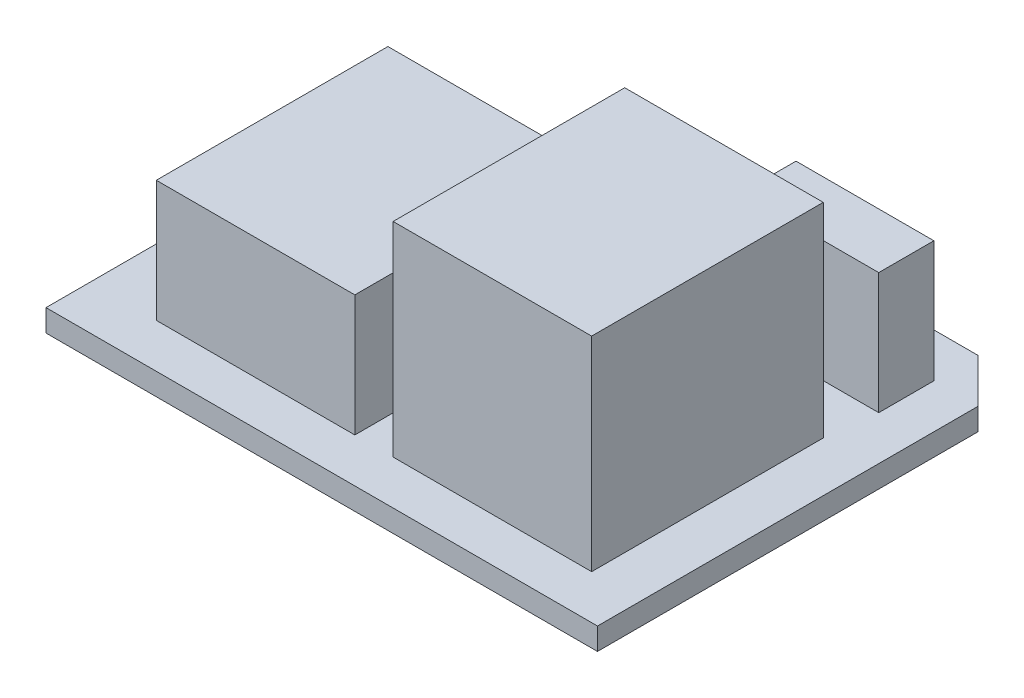
ISO-10303-21;
HEADER;
FILE_DESCRIPTION(('STEP AP214'),'2;1');
FILE_NAME('part.step','',(''),(''),'','','');
FILE_SCHEMA(('AUTOMOTIVE_DESIGN { 1 0 10303 214 1 1 1 1 }'));
ENDSEC;
DATA;
#1=APPLICATION_CONTEXT('core data for automotive mechanical design processes');
#2=APPLICATION_PROTOCOL_DEFINITION('international standard','automotive_design',2000,#1);
#3=PRODUCT_CONTEXT('',#1,'mechanical');
#4=PRODUCT('Part','Part','',(#3));
#5=PRODUCT_RELATED_PRODUCT_CATEGORY('part','',(#4));
#6=PRODUCT_DEFINITION_FORMATION('','',#4);
#7=PRODUCT_DEFINITION_CONTEXT('part definition',#1,'design');
#8=PRODUCT_DEFINITION('design','',#6,#7);
#9=PRODUCT_DEFINITION_SHAPE('','',#8);
#10=(LENGTH_UNIT() NAMED_UNIT(*) SI_UNIT(.MILLI.,.METRE.));
#11=(NAMED_UNIT(*) PLANE_ANGLE_UNIT() SI_UNIT($,.RADIAN.));
#12=(NAMED_UNIT(*) SI_UNIT($,.STERADIAN.) SOLID_ANGLE_UNIT());
#13=UNCERTAINTY_MEASURE_WITH_UNIT(LENGTH_MEASURE(1.E-05),#10,'distance_accuracy_value','');
#14=(GEOMETRIC_REPRESENTATION_CONTEXT(3) GLOBAL_UNCERTAINTY_ASSIGNED_CONTEXT((#13)) GLOBAL_UNIT_ASSIGNED_CONTEXT((#10,
#11,#12)) REPRESENTATION_CONTEXT('',''));
#15=CARTESIAN_POINT('',(0.,0.,0.));
#16=DIRECTION('',(0.,0.,1.));
#17=DIRECTION('',(1.,0.,0.));
#18=AXIS2_PLACEMENT_3D('',#15,#16,#17);
#19=CARTESIAN_POINT('',(0.,2.,0.));
#20=DIRECTION('',(0.,1.,0.));
#21=DIRECTION('',(0.,0.,1.));
#22=AXIS2_PLACEMENT_3D('',#19,#20,#21);
#23=PLANE('',#22);
#24=DIRECTION('',(0.707106781186548,0.,0.707106781186548));
#25=VECTOR('',#24,1.);
#26=CARTESIAN_POINT('',(20.125,2.,-20.125));
#27=LINE('',#26,#25);
#28=CARTESIAN_POINT('',(21.,2.,-19.25));
#29=VERTEX_POINT('',#28);
#30=CARTESIAN_POINT('',(25.,2.,-15.25));
#31=VERTEX_POINT('',#30);
#32=EDGE_CURVE('E296',#29,#31,#27,.T.);
#33=ORIENTED_EDGE('',*,*,#32,.F.);
#34=DIRECTION('',(1.,0.,0.));
#35=VECTOR('',#34,1.);
#36=CARTESIAN_POINT('',(0.,2.,-19.25));
#37=LINE('',#36,#35);
#38=CARTESIAN_POINT('',(5.5,2.,-19.25));
#39=VERTEX_POINT('',#38);
#40=EDGE_CURVE('E300',#39,#29,#37,.T.);
#41=ORIENTED_EDGE('',*,*,#40,.F.);
#42=DIRECTION('',(0.707106781186548,0.,-0.707106781186548));
#43=VECTOR('',#42,1.);
#44=CARTESIAN_POINT('',(-6.875,2.,-6.875));
#45=LINE('',#44,#43);
#46=CARTESIAN_POINT('',(-1.00000000000001,2.,-12.75));
#47=VERTEX_POINT('',#46);
#48=EDGE_CURVE('E305',#47,#39,#45,.T.);
#49=ORIENTED_EDGE('',*,*,#48,.F.);
#50=DIRECTION('',(1.,0.,0.));
#51=VECTOR('',#50,1.);
#52=CARTESIAN_POINT('',(0.,2.,-12.75));
#53=LINE('',#52,#51);
#54=CARTESIAN_POINT('',(-20.,2.,-12.75));
#55=VERTEX_POINT('',#54);
#56=EDGE_CURVE('E309',#55,#47,#53,.T.);
#57=ORIENTED_EDGE('',*,*,#56,.F.);
#58=DIRECTION('',(-0.707106781186548,0.,0.707106781186548));
#59=VECTOR('',#58,1.);
#60=CARTESIAN_POINT('',(-16.375,2.,-16.375));
#61=LINE('',#60,#59);
#62=CARTESIAN_POINT('',(-25.,2.,-7.75));
#63=VERTEX_POINT('',#62);
#64=EDGE_CURVE('E313',#55,#63,#61,.T.);
#65=ORIENTED_EDGE('',*,*,#64,.T.);
#66=DIRECTION('',(0.,0.,1.));
#67=VECTOR('',#66,1.);
#68=CARTESIAN_POINT('',(-25.,2.,0.));
#69=LINE('',#68,#67);
#70=CARTESIAN_POINT('',(-25.,2.,19.25));
#71=VERTEX_POINT('',#70);
#72=EDGE_CURVE('E316',#63,#71,#69,.T.);
#73=ORIENTED_EDGE('',*,*,#72,.T.);
#74=DIRECTION('',(1.,0.,0.));
#75=VECTOR('',#74,1.);
#76=CARTESIAN_POINT('',(0.,2.,19.25));
#77=LINE('',#76,#75);
#78=CARTESIAN_POINT('',(25.,2.,19.25));
#79=VERTEX_POINT('',#78);
#80=EDGE_CURVE('E319',#71,#79,#77,.T.);
#81=ORIENTED_EDGE('',*,*,#80,.T.);
#82=DIRECTION('',(0.,0.,1.));
#83=VECTOR('',#82,1.);
#84=CARTESIAN_POINT('',(25.,2.,0.));
#85=LINE('',#84,#83);
#86=EDGE_CURVE('E322',#31,#79,#85,.T.);
#87=ORIENTED_EDGE('',*,*,#86,.F.);
#88=EDGE_LOOP('',(#33,#41,#49,#57,#65,#73,#81,#87));
#89=FACE_BOUND('',#88,.T.);
#90=DIRECTION('',(-1.,0.,0.));
#91=VECTOR('',#90,1.);
#92=CARTESIAN_POINT('',(-19.,2.,-5.75));
#93=LINE('',#92,#91);
#94=CARTESIAN_POINT('',(-1.00000000000001,2.,-5.75));
#95=VERTEX_POINT('',#94);
#96=CARTESIAN_POINT('',(-19.,2.,-5.75));
#97=VERTEX_POINT('',#96);
#98=EDGE_CURVE('E273',#95,#97,#93,.T.);
#99=ORIENTED_EDGE('',*,*,#98,.F.);
#100=DIRECTION('',(0.,0.,-1.));
#101=VECTOR('',#100,1.);
#102=CARTESIAN_POINT('',(-1.00000000000001,2.,-5.75));
#103=LINE('',#102,#101);
#104=CARTESIAN_POINT('',(-1.00000000000001,2.,15.25));
#105=VERTEX_POINT('',#104);
#106=EDGE_CURVE('E254',#105,#95,#103,.T.);
#107=ORIENTED_EDGE('',*,*,#106,.F.);
#108=DIRECTION('',(1.,0.,0.));
#109=VECTOR('',#108,1.);
#110=CARTESIAN_POINT('',(-19.,2.,15.25));
#111=LINE('',#110,#109);
#112=CARTESIAN_POINT('',(-19.,2.,15.25));
#113=VERTEX_POINT('',#112);
#114=EDGE_CURVE('E260',#113,#105,#111,.T.);
#115=ORIENTED_EDGE('',*,*,#114,.F.);
#116=DIRECTION('',(0.,0.,1.));
#117=VECTOR('',#116,1.);
#118=CARTESIAN_POINT('',(-19.,2.,-5.75));
#119=LINE('',#118,#117);
#120=EDGE_CURVE('E276',#97,#113,#119,.T.);
#121=ORIENTED_EDGE('',*,*,#120,.F.);
#122=EDGE_LOOP('',(#99,#107,#115,#121));
#123=FACE_BOUND('',#122,.T.);
#124=DIRECTION('',(-1.,0.,0.));
#125=VECTOR('',#124,1.);
#126=CARTESIAN_POINT('',(2.47105650587214,2.,-5.75));
#127=LINE('',#126,#125);
#128=CARTESIAN_POINT('',(20.4710565058721,2.,-5.75));
#129=VERTEX_POINT('',#128);
#130=CARTESIAN_POINT('',(2.47105650587214,2.,-5.75));
#131=VERTEX_POINT('',#130);
#132=EDGE_CURVE('E215',#129,#131,#127,.T.);
#133=ORIENTED_EDGE('',*,*,#132,.F.);
#134=DIRECTION('',(0.,0.,-1.));
#135=VECTOR('',#134,1.);
#136=CARTESIAN_POINT('',(20.4710565058721,2.,-5.75));
#137=LINE('',#136,#135);
#138=CARTESIAN_POINT('',(20.4710565058721,2.,15.25));
#139=VERTEX_POINT('',#138);
#140=EDGE_CURVE('E210',#139,#129,#137,.T.);
#141=ORIENTED_EDGE('',*,*,#140,.F.);
#142=DIRECTION('',(1.,0.,0.));
#143=VECTOR('',#142,1.);
#144=CARTESIAN_POINT('',(2.47105650587215,2.,15.25));
#145=LINE('',#144,#143);
#146=CARTESIAN_POINT('',(2.47105650587215,2.,15.25));
#147=VERTEX_POINT('',#146);
#148=EDGE_CURVE('E225',#147,#139,#145,.T.);
#149=ORIENTED_EDGE('',*,*,#148,.F.);
#150=DIRECTION('',(0.,0.,1.));
#151=VECTOR('',#150,1.);
#152=CARTESIAN_POINT('',(2.47105650587214,2.,-5.75));
#153=LINE('',#152,#151);
#154=EDGE_CURVE('E237',#131,#147,#153,.T.);
#155=ORIENTED_EDGE('',*,*,#154,.F.);
#156=EDGE_LOOP('',(#133,#141,#149,#155));
#157=FACE_BOUND('',#156,.T.);
#158=DIRECTION('',(-1.,0.,0.));
#159=VECTOR('',#158,1.);
#160=CARTESIAN_POINT('',(8.5,2.,-15.25));
#161=LINE('',#160,#159);
#162=CARTESIAN_POINT('',(21.,2.,-15.25));
#163=VERTEX_POINT('',#162);
#164=CARTESIAN_POINT('',(8.5,2.,-15.25));
#165=VERTEX_POINT('',#164);
#166=EDGE_CURVE('E691',#163,#165,#161,.T.);
#167=ORIENTED_EDGE('',*,*,#166,.F.);
#168=DIRECTION('',(0.,0.,-1.));
#169=VECTOR('',#168,1.);
#170=CARTESIAN_POINT('',(21.,2.,-15.25));
#171=LINE('',#170,#169);
#172=CARTESIAN_POINT('',(21.,2.,-10.25));
#173=VERTEX_POINT('',#172);
#174=EDGE_CURVE('E207',#173,#163,#171,.T.);
#175=ORIENTED_EDGE('',*,*,#174,.F.);
#176=DIRECTION('',(1.,0.,0.));
#177=VECTOR('',#176,1.);
#178=CARTESIAN_POINT('',(8.5,2.,-10.25));
#179=LINE('',#178,#177);
#180=CARTESIAN_POINT('',(8.5,2.,-10.25));
#181=VERTEX_POINT('',#180);
#182=EDGE_CURVE('E203',#181,#173,#179,.T.);
#183=ORIENTED_EDGE('',*,*,#182,.F.);
#184=DIRECTION('',(0.,0.,1.));
#185=VECTOR('',#184,1.);
#186=CARTESIAN_POINT('',(8.5,2.,-15.25));
#187=LINE('',#186,#185);
#188=EDGE_CURVE('E687',#165,#181,#187,.T.);
#189=ORIENTED_EDGE('',*,*,#188,.F.);
#190=EDGE_LOOP('',(#167,#175,#183,#189));
#191=FACE_BOUND('',#190,.T.);
#192=ADVANCED_FACE('F44',(#89,#123,#157,#191),#23,.T.);
#193=CARTESIAN_POINT('',(20.125,2.,-20.125));
#194=DIRECTION('',(0.707106781186547,0.,-0.707106781186547));
#195=DIRECTION('',(-0.707106781186548,0.,-0.707106781186548));
#196=AXIS2_PLACEMENT_3D('',#193,#194,#195);
#197=PLANE('',#196);
#198=DIRECTION('',(0.707106781186548,0.,0.707106781186548));
#199=VECTOR('',#198,1.);
#200=CARTESIAN_POINT('',(20.125,0.,-20.125));
#201=LINE('',#200,#199);
#202=CARTESIAN_POINT('',(21.,0.,-19.25));
#203=VERTEX_POINT('',#202);
#204=CARTESIAN_POINT('',(25.,0.,-15.25));
#205=VERTEX_POINT('',#204);
#206=EDGE_CURVE('E295',#203,#205,#201,.T.);
#207=ORIENTED_EDGE('',*,*,#206,.F.);
#208=DIRECTION('',(0.,-1.,0.));
#209=VECTOR('',#208,1.);
#210=CARTESIAN_POINT('',(21.,2.,-19.25));
#211=LINE('',#210,#209);
#212=EDGE_CURVE('E11',#29,#203,#211,.T.);
#213=ORIENTED_EDGE('',*,*,#212,.F.);
#214=ORIENTED_EDGE('',*,*,#32,.T.);
#215=DIRECTION('',(0.,-1.,0.));
#216=VECTOR('',#215,1.);
#217=CARTESIAN_POINT('',(25.,2.,-15.25));
#218=LINE('',#217,#216);
#219=EDGE_CURVE('E326',#31,#205,#218,.T.);
#220=ORIENTED_EDGE('',*,*,#219,.T.);
#221=EDGE_LOOP('',(#207,#213,#214,#220));
#222=FACE_BOUND('',#221,.T.);
#223=ADVANCED_FACE('F46',(#222),#197,.T.);
#224=CARTESIAN_POINT('',(0.,2.,-19.25));
#225=DIRECTION('',(0.,0.,-1.));
#226=DIRECTION('',(-1.,0.,0.));
#227=AXIS2_PLACEMENT_3D('',#224,#225,#226);
#228=PLANE('',#227);
#229=DIRECTION('',(1.,0.,0.));
#230=VECTOR('',#229,1.);
#231=CARTESIAN_POINT('',(0.,0.,-19.25));
#232=LINE('',#231,#230);
#233=CARTESIAN_POINT('',(5.5,0.,-19.25));
#234=VERTEX_POINT('',#233);
#235=EDGE_CURVE('E330',#234,#203,#232,.T.);
#236=ORIENTED_EDGE('',*,*,#235,.F.);
#237=DIRECTION('',(0.,-1.,0.));
#238=VECTOR('',#237,1.);
#239=CARTESIAN_POINT('',(5.5,2.,-19.25));
#240=LINE('',#239,#238);
#241=EDGE_CURVE('E53',#39,#234,#240,.T.);
#242=ORIENTED_EDGE('',*,*,#241,.F.);
#243=ORIENTED_EDGE('',*,*,#40,.T.);
#244=ORIENTED_EDGE('',*,*,#212,.T.);
#245=EDGE_LOOP('',(#236,#242,#243,#244));
#246=FACE_BOUND('',#245,.T.);
#247=ADVANCED_FACE('F381',(#246),#228,.T.);
#248=CARTESIAN_POINT('',(-6.875,2.,-6.875));
#249=DIRECTION('',(-0.707106781186547,0.,-0.707106781186547));
#250=DIRECTION('',(-0.707106781186548,0.,0.707106781186548));
#251=AXIS2_PLACEMENT_3D('',#248,#249,#250);
#252=PLANE('',#251);
#253=DIRECTION('',(0.707106781186548,0.,-0.707106781186548));
#254=VECTOR('',#253,1.);
#255=CARTESIAN_POINT('',(-6.875,0.,-6.875));
#256=LINE('',#255,#254);
#257=CARTESIAN_POINT('',(-1.00000000000001,0.,-12.75));
#258=VERTEX_POINT('',#257);
#259=EDGE_CURVE('E334',#258,#234,#256,.T.);
#260=ORIENTED_EDGE('',*,*,#259,.F.);
#261=DIRECTION('',(0.,-1.,0.));
#262=VECTOR('',#261,1.);
#263=CARTESIAN_POINT('',(-1.00000000000001,2.,-12.75));
#264=LINE('',#263,#262);
#265=EDGE_CURVE('E371',#47,#258,#264,.T.);
#266=ORIENTED_EDGE('',*,*,#265,.F.);
#267=ORIENTED_EDGE('',*,*,#48,.T.);
#268=ORIENTED_EDGE('',*,*,#241,.T.);
#269=EDGE_LOOP('',(#260,#266,#267,#268));
#270=FACE_BOUND('',#269,.T.);
#271=ADVANCED_FACE('F377',(#270),#252,.T.);
#272=CARTESIAN_POINT('',(0.,2.,-12.75));
#273=DIRECTION('',(0.,0.,-1.));
#274=DIRECTION('',(-1.,0.,0.));
#275=AXIS2_PLACEMENT_3D('',#272,#273,#274);
#276=PLANE('',#275);
#277=DIRECTION('',(1.,0.,0.));
#278=VECTOR('',#277,1.);
#279=CARTESIAN_POINT('',(0.,0.,-12.75));
#280=LINE('',#279,#278);
#281=CARTESIAN_POINT('',(-20.,0.,-12.75));
#282=VERTEX_POINT('',#281);
#283=EDGE_CURVE('E338',#282,#258,#280,.T.);
#284=ORIENTED_EDGE('',*,*,#283,.F.);
#285=DIRECTION('',(0.,-1.,0.));
#286=VECTOR('',#285,1.);
#287=CARTESIAN_POINT('',(-20.,2.,-12.75));
#288=LINE('',#287,#286);
#289=EDGE_CURVE('E368',#55,#282,#288,.T.);
#290=ORIENTED_EDGE('',*,*,#289,.F.);
#291=ORIENTED_EDGE('',*,*,#56,.T.);
#292=ORIENTED_EDGE('',*,*,#265,.T.);
#293=EDGE_LOOP('',(#284,#290,#291,#292));
#294=FACE_BOUND('',#293,.T.);
#295=ADVANCED_FACE('F389',(#294),#276,.T.);
#296=CARTESIAN_POINT('',(-16.375,2.,-16.375));
#297=DIRECTION('',(0.707106781186547,0.,0.707106781186547));
#298=DIRECTION('',(0.707106781186548,0.,-0.707106781186548));
#299=AXIS2_PLACEMENT_3D('',#296,#297,#298);
#300=PLANE('',#299);
#301=DIRECTION('',(-0.707106781186548,0.,0.707106781186548));
#302=VECTOR('',#301,1.);
#303=CARTESIAN_POINT('',(-16.375,0.,-16.375));
#304=LINE('',#303,#302);
#305=CARTESIAN_POINT('',(-25.,0.,-7.75));
#306=VERTEX_POINT('',#305);
#307=EDGE_CURVE('E342',#282,#306,#304,.T.);
#308=ORIENTED_EDGE('',*,*,#307,.T.);
#309=DIRECTION('',(0.,-1.,0.));
#310=VECTOR('',#309,1.);
#311=CARTESIAN_POINT('',(-25.,2.,-7.75));
#312=LINE('',#311,#310);
#313=EDGE_CURVE('E364',#63,#306,#312,.T.);
#314=ORIENTED_EDGE('',*,*,#313,.F.);
#315=ORIENTED_EDGE('',*,*,#64,.F.);
#316=ORIENTED_EDGE('',*,*,#289,.T.);
#317=EDGE_LOOP('',(#308,#314,#315,#316));
#318=FACE_BOUND('',#317,.T.);
#319=ADVANCED_FACE('F411',(#318),#300,.F.);
#320=CARTESIAN_POINT('',(-25.,2.,0.));
#321=DIRECTION('',(1.,0.,0.));
#322=DIRECTION('',(0.,0.,-1.));
#323=AXIS2_PLACEMENT_3D('',#320,#321,#322);
#324=PLANE('',#323);
#325=DIRECTION('',(0.,0.,1.));
#326=VECTOR('',#325,1.);
#327=CARTESIAN_POINT('',(-25.,0.,0.));
#328=LINE('',#327,#326);
#329=CARTESIAN_POINT('',(-25.,0.,19.25));
#330=VERTEX_POINT('',#329);
#331=EDGE_CURVE('E345',#306,#330,#328,.T.);
#332=ORIENTED_EDGE('',*,*,#331,.T.);
#333=DIRECTION('',(0.,-1.,0.));
#334=VECTOR('',#333,1.);
#335=CARTESIAN_POINT('',(-25.,2.,19.25));
#336=LINE('',#335,#334);
#337=EDGE_CURVE('E360',#71,#330,#336,.T.);
#338=ORIENTED_EDGE('',*,*,#337,.F.);
#339=ORIENTED_EDGE('',*,*,#72,.F.);
#340=ORIENTED_EDGE('',*,*,#313,.T.);
#341=EDGE_LOOP('',(#332,#338,#339,#340));
#342=FACE_BOUND('',#341,.T.);
#343=ADVANCED_FACE('F407',(#342),#324,.F.);
#344=CARTESIAN_POINT('',(0.,2.,19.25));
#345=DIRECTION('',(0.,0.,-1.));
#346=DIRECTION('',(-1.,0.,0.));
#347=AXIS2_PLACEMENT_3D('',#344,#345,#346);
#348=PLANE('',#347);
#349=DIRECTION('',(1.,0.,0.));
#350=VECTOR('',#349,1.);
#351=CARTESIAN_POINT('',(0.,0.,19.25));
#352=LINE('',#351,#350);
#353=CARTESIAN_POINT('',(25.,0.,19.25));
#354=VERTEX_POINT('',#353);
#355=EDGE_CURVE('E348',#330,#354,#352,.T.);
#356=ORIENTED_EDGE('',*,*,#355,.T.);
#357=DIRECTION('',(0.,-1.,0.));
#358=VECTOR('',#357,1.);
#359=CARTESIAN_POINT('',(25.,2.,19.25));
#360=LINE('',#359,#358);
#361=EDGE_CURVE('E357',#79,#354,#360,.T.);
#362=ORIENTED_EDGE('',*,*,#361,.F.);
#363=ORIENTED_EDGE('',*,*,#80,.F.);
#364=ORIENTED_EDGE('',*,*,#337,.T.);
#365=EDGE_LOOP('',(#356,#362,#363,#364));
#366=FACE_BOUND('',#365,.T.);
#367=ADVANCED_FACE('F404',(#366),#348,.F.);
#368=CARTESIAN_POINT('',(25.,2.,0.));
#369=DIRECTION('',(1.,0.,0.));
#370=DIRECTION('',(0.,0.,-1.));
#371=AXIS2_PLACEMENT_3D('',#368,#369,#370);
#372=PLANE('',#371);
#373=DIRECTION('',(0.,0.,1.));
#374=VECTOR('',#373,1.);
#375=CARTESIAN_POINT('',(25.,0.,0.));
#376=LINE('',#375,#374);
#377=EDGE_CURVE('E301',#205,#354,#376,.T.);
#378=ORIENTED_EDGE('',*,*,#377,.F.);
#379=ORIENTED_EDGE('',*,*,#219,.F.);
#380=ORIENTED_EDGE('',*,*,#86,.T.);
#381=ORIENTED_EDGE('',*,*,#361,.T.);
#382=EDGE_LOOP('',(#378,#379,#380,#381));
#383=FACE_BOUND('',#382,.T.);
#384=ADVANCED_FACE('F400',(#383),#372,.T.);
#385=CARTESIAN_POINT('',(0.,0.,0.));
#386=DIRECTION('',(0.,1.,0.));
#387=DIRECTION('',(0.,0.,1.));
#388=AXIS2_PLACEMENT_3D('',#385,#386,#387);
#389=PLANE('',#388);
#390=ORIENTED_EDGE('',*,*,#206,.T.);
#391=ORIENTED_EDGE('',*,*,#377,.T.);
#392=ORIENTED_EDGE('',*,*,#355,.F.);
#393=ORIENTED_EDGE('',*,*,#331,.F.);
#394=ORIENTED_EDGE('',*,*,#307,.F.);
#395=ORIENTED_EDGE('',*,*,#283,.T.);
#396=ORIENTED_EDGE('',*,*,#259,.T.);
#397=ORIENTED_EDGE('',*,*,#235,.T.);
#398=EDGE_LOOP('',(#390,#391,#392,#393,#394,#395,#396,#397));
#399=FACE_BOUND('',#398,.T.);
#400=ADVANCED_FACE('F384',(#399),#389,.F.);
#401=CARTESIAN_POINT('',(-1.00000000000001,13.,-5.75));
#402=DIRECTION('',(-1.,0.,0.));
#403=DIRECTION('',(0.,0.,1.));
#404=AXIS2_PLACEMENT_3D('',#401,#402,#403);
#405=PLANE('',#404);
#406=ORIENTED_EDGE('',*,*,#106,.T.);
#407=DIRECTION('',(0.,-1.,0.));
#408=VECTOR('',#407,1.);
#409=CARTESIAN_POINT('',(-1.00000000000001,13.,-5.75));
#410=LINE('',#409,#408);
#411=CARTESIAN_POINT('',(-1.00000000000001,13.,-5.75));
#412=VERTEX_POINT('',#411);
#413=EDGE_CURVE('E292',#412,#95,#410,.T.);
#414=ORIENTED_EDGE('',*,*,#413,.F.);
#415=DIRECTION('',(0.,0.,-1.));
#416=VECTOR('',#415,1.);
#417=CARTESIAN_POINT('',(-1.00000000000001,13.,-5.75));
#418=LINE('',#417,#416);
#419=CARTESIAN_POINT('',(-1.00000000000001,13.,15.25));
#420=VERTEX_POINT('',#419);
#421=EDGE_CURVE('E255',#420,#412,#418,.T.);
#422=ORIENTED_EDGE('',*,*,#421,.F.);
#423=DIRECTION('',(0.,-1.,0.));
#424=VECTOR('',#423,1.);
#425=CARTESIAN_POINT('',(-1.00000000000001,13.,15.25));
#426=LINE('',#425,#424);
#427=EDGE_CURVE('E269',#420,#105,#426,.T.);
#428=ORIENTED_EDGE('',*,*,#427,.T.);
#429=EDGE_LOOP('',(#406,#414,#422,#428));
#430=FACE_BOUND('',#429,.T.);
#431=ADVANCED_FACE('F427',(#430),#405,.F.);
#432=CARTESIAN_POINT('',(-19.,13.,-5.75));
#433=DIRECTION('',(0.,0.,1.));
#434=DIRECTION('',(1.,0.,0.));
#435=AXIS2_PLACEMENT_3D('',#432,#433,#434);
#436=PLANE('',#435);
#437=ORIENTED_EDGE('',*,*,#98,.T.);
#438=DIRECTION('',(0.,-1.,0.));
#439=VECTOR('',#438,1.);
#440=CARTESIAN_POINT('',(-19.,13.,-5.75));
#441=LINE('',#440,#439);
#442=CARTESIAN_POINT('',(-19.,13.,-5.75));
#443=VERTEX_POINT('',#442);
#444=EDGE_CURVE('E288',#443,#97,#441,.T.);
#445=ORIENTED_EDGE('',*,*,#444,.F.);
#446=DIRECTION('',(-1.,0.,0.));
#447=VECTOR('',#446,1.);
#448=CARTESIAN_POINT('',(-19.,13.,-5.75));
#449=LINE('',#448,#447);
#450=EDGE_CURVE('E259',#412,#443,#449,.T.);
#451=ORIENTED_EDGE('',*,*,#450,.F.);
#452=ORIENTED_EDGE('',*,*,#413,.T.);
#453=EDGE_LOOP('',(#437,#445,#451,#452));
#454=FACE_BOUND('',#453,.T.);
#455=ADVANCED_FACE('F452',(#454),#436,.F.);
#456=CARTESIAN_POINT('',(-19.,13.,-5.75));
#457=DIRECTION('',(1.,0.,0.));
#458=DIRECTION('',(0.,0.,-1.));
#459=AXIS2_PLACEMENT_3D('',#456,#457,#458);
#460=PLANE('',#459);
#461=ORIENTED_EDGE('',*,*,#120,.T.);
#462=DIRECTION('',(0.,-1.,0.));
#463=VECTOR('',#462,1.);
#464=CARTESIAN_POINT('',(-19.,13.,15.25));
#465=LINE('',#464,#463);
#466=CARTESIAN_POINT('',(-19.,13.,15.25));
#467=VERTEX_POINT('',#466);
#468=EDGE_CURVE('E285',#467,#113,#465,.T.);
#469=ORIENTED_EDGE('',*,*,#468,.F.);
#470=DIRECTION('',(0.,0.,1.));
#471=VECTOR('',#470,1.);
#472=CARTESIAN_POINT('',(-19.,13.,-5.75));
#473=LINE('',#472,#471);
#474=EDGE_CURVE('E263',#443,#467,#473,.T.);
#475=ORIENTED_EDGE('',*,*,#474,.F.);
#476=ORIENTED_EDGE('',*,*,#444,.T.);
#477=EDGE_LOOP('',(#461,#469,#475,#476));
#478=FACE_BOUND('',#477,.T.);
#479=ADVANCED_FACE('F459',(#478),#460,.F.);
#480=CARTESIAN_POINT('',(-19.,13.,15.25));
#481=DIRECTION('',(0.,0.,-1.));
#482=DIRECTION('',(-1.,0.,0.));
#483=AXIS2_PLACEMENT_3D('',#480,#481,#482);
#484=PLANE('',#483);
#485=ORIENTED_EDGE('',*,*,#114,.T.);
#486=ORIENTED_EDGE('',*,*,#427,.F.);
#487=DIRECTION('',(1.,0.,0.));
#488=VECTOR('',#487,1.);
#489=CARTESIAN_POINT('',(-19.,13.,15.25));
#490=LINE('',#489,#488);
#491=EDGE_CURVE('E266',#467,#420,#490,.T.);
#492=ORIENTED_EDGE('',*,*,#491,.F.);
#493=ORIENTED_EDGE('',*,*,#468,.T.);
#494=EDGE_LOOP('',(#485,#486,#492,#493));
#495=FACE_BOUND('',#494,.T.);
#496=ADVANCED_FACE('F466',(#495),#484,.F.);
#497=CARTESIAN_POINT('',(0.,13.,0.));
#498=DIRECTION('',(0.,1.,0.));
#499=DIRECTION('',(0.,0.,1.));
#500=AXIS2_PLACEMENT_3D('',#497,#498,#499);
#501=PLANE('',#500);
#502=ORIENTED_EDGE('',*,*,#421,.T.);
#503=ORIENTED_EDGE('',*,*,#450,.T.);
#504=ORIENTED_EDGE('',*,*,#474,.T.);
#505=ORIENTED_EDGE('',*,*,#491,.T.);
#506=EDGE_LOOP('',(#502,#503,#504,#505));
#507=FACE_BOUND('',#506,.T.);
#508=ADVANCED_FACE('F474',(#507),#501,.T.);
#509=CARTESIAN_POINT('',(20.4710565058721,20.5,-5.75));
#510=DIRECTION('',(-1.,0.,0.));
#511=DIRECTION('',(0.,0.,1.));
#512=AXIS2_PLACEMENT_3D('',#509,#510,#511);
#513=PLANE('',#512);
#514=ORIENTED_EDGE('',*,*,#140,.T.);
#515=DIRECTION('',(0.,-1.,0.));
#516=VECTOR('',#515,1.);
#517=CARTESIAN_POINT('',(20.4710565058721,20.5,-5.75));
#518=LINE('',#517,#516);
#519=CARTESIAN_POINT('',(20.4710565058721,20.5,-5.75));
#520=VERTEX_POINT('',#519);
#521=EDGE_CURVE('E251',#520,#129,#518,.T.);
#522=ORIENTED_EDGE('',*,*,#521,.F.);
#523=DIRECTION('',(0.,0.,-1.));
#524=VECTOR('',#523,1.);
#525=CARTESIAN_POINT('',(20.4710565058721,20.5,-5.75));
#526=LINE('',#525,#524);
#527=CARTESIAN_POINT('',(20.4710565058721,20.5,15.25));
#528=VERTEX_POINT('',#527);
#529=EDGE_CURVE('E220',#528,#520,#526,.T.);
#530=ORIENTED_EDGE('',*,*,#529,.F.);
#531=DIRECTION('',(0.,-1.,0.));
#532=VECTOR('',#531,1.);
#533=CARTESIAN_POINT('',(20.4710565058721,20.5,15.25));
#534=LINE('',#533,#532);
#535=EDGE_CURVE('E233',#528,#139,#534,.T.);
#536=ORIENTED_EDGE('',*,*,#535,.T.);
#537=EDGE_LOOP('',(#514,#522,#530,#536));
#538=FACE_BOUND('',#537,.T.);
#539=ADVANCED_FACE('F482',(#538),#513,.F.);
#540=CARTESIAN_POINT('',(2.47105650587214,20.5,-5.75));
#541=DIRECTION('',(0.,0.,1.));
#542=DIRECTION('',(1.,0.,0.));
#543=AXIS2_PLACEMENT_3D('',#540,#541,#542);
#544=PLANE('',#543);
#545=ORIENTED_EDGE('',*,*,#132,.T.);
#546=DIRECTION('',(0.,-1.,0.));
#547=VECTOR('',#546,1.);
#548=CARTESIAN_POINT('',(2.47105650587214,20.5,-5.75));
#549=LINE('',#548,#547);
#550=CARTESIAN_POINT('',(2.47105650587214,20.5,-5.75));
#551=VERTEX_POINT('',#550);
#552=EDGE_CURVE('E247',#551,#131,#549,.T.);
#553=ORIENTED_EDGE('',*,*,#552,.F.);
#554=DIRECTION('',(-1.,0.,0.));
#555=VECTOR('',#554,1.);
#556=CARTESIAN_POINT('',(2.47105650587214,20.5,-5.75));
#557=LINE('',#556,#555);
#558=EDGE_CURVE('E224',#520,#551,#557,.T.);
#559=ORIENTED_EDGE('',*,*,#558,.F.);
#560=ORIENTED_EDGE('',*,*,#521,.T.);
#561=EDGE_LOOP('',(#545,#553,#559,#560));
#562=FACE_BOUND('',#561,.T.);
#563=ADVANCED_FACE('F490',(#562),#544,.F.);
#564=CARTESIAN_POINT('',(2.47105650587214,20.5,-5.75));
#565=DIRECTION('',(1.,0.,0.));
#566=DIRECTION('',(0.,0.,-1.));
#567=AXIS2_PLACEMENT_3D('',#564,#565,#566);
#568=PLANE('',#567);
#569=ORIENTED_EDGE('',*,*,#154,.T.);
#570=DIRECTION('',(0.,-1.,0.));
#571=VECTOR('',#570,1.);
#572=CARTESIAN_POINT('',(2.47105650587215,20.5,15.25));
#573=LINE('',#572,#571);
#574=CARTESIAN_POINT('',(2.47105650587215,20.5,15.25));
#575=VERTEX_POINT('',#574);
#576=EDGE_CURVE('E68',#575,#147,#573,.T.);
#577=ORIENTED_EDGE('',*,*,#576,.F.);
#578=DIRECTION('',(0.,0.,1.));
#579=VECTOR('',#578,1.);
#580=CARTESIAN_POINT('',(2.47105650587214,20.5,-5.75));
#581=LINE('',#580,#579);
#582=EDGE_CURVE('E228',#551,#575,#581,.T.);
#583=ORIENTED_EDGE('',*,*,#582,.F.);
#584=ORIENTED_EDGE('',*,*,#552,.T.);
#585=EDGE_LOOP('',(#569,#577,#583,#584));
#586=FACE_BOUND('',#585,.T.);
#587=ADVANCED_FACE('F498',(#586),#568,.F.);
#588=CARTESIAN_POINT('',(2.47105650587215,20.5,15.25));
#589=DIRECTION('',(0.,0.,-1.));
#590=DIRECTION('',(-1.,0.,0.));
#591=AXIS2_PLACEMENT_3D('',#588,#589,#590);
#592=PLANE('',#591);
#593=ORIENTED_EDGE('',*,*,#148,.T.);
#594=ORIENTED_EDGE('',*,*,#535,.F.);
#595=DIRECTION('',(1.,0.,0.));
#596=VECTOR('',#595,1.);
#597=CARTESIAN_POINT('',(2.47105650587215,20.5,15.25));
#598=LINE('',#597,#596);
#599=EDGE_CURVE('E231',#575,#528,#598,.T.);
#600=ORIENTED_EDGE('',*,*,#599,.F.);
#601=ORIENTED_EDGE('',*,*,#576,.T.);
#602=EDGE_LOOP('',(#593,#594,#600,#601));
#603=FACE_BOUND('',#602,.T.);
#604=ADVANCED_FACE('F506',(#603),#592,.F.);
#605=CARTESIAN_POINT('',(0.,20.5,0.));
#606=DIRECTION('',(0.,1.,0.));
#607=DIRECTION('',(0.,0.,1.));
#608=AXIS2_PLACEMENT_3D('',#605,#606,#607);
#609=PLANE('',#608);
#610=ORIENTED_EDGE('',*,*,#529,.T.);
#611=ORIENTED_EDGE('',*,*,#558,.T.);
#612=ORIENTED_EDGE('',*,*,#582,.T.);
#613=ORIENTED_EDGE('',*,*,#599,.T.);
#614=EDGE_LOOP('',(#610,#611,#612,#613));
#615=FACE_BOUND('',#614,.T.);
#616=ADVANCED_FACE('F514',(#615),#609,.T.);
#617=CARTESIAN_POINT('',(21.,13.,-15.25));
#618=DIRECTION('',(-1.,0.,0.));
#619=DIRECTION('',(0.,0.,1.));
#620=AXIS2_PLACEMENT_3D('',#617,#618,#619);
#621=PLANE('',#620);
#622=ORIENTED_EDGE('',*,*,#174,.T.);
#623=DIRECTION('',(0.,-1.,0.));
#624=VECTOR('',#623,1.);
#625=CARTESIAN_POINT('',(21.,13.,-15.25));
#626=LINE('',#625,#624);
#627=CARTESIAN_POINT('',(21.,13.,-15.25));
#628=VERTEX_POINT('',#627);
#629=EDGE_CURVE('E186',#628,#163,#626,.T.);
#630=ORIENTED_EDGE('',*,*,#629,.F.);
#631=DIRECTION('',(0.,0.,-1.));
#632=VECTOR('',#631,1.);
#633=CARTESIAN_POINT('',(21.,13.,-15.25));
#634=LINE('',#633,#632);
#635=CARTESIAN_POINT('',(21.,13.,-10.25));
#636=VERTEX_POINT('',#635);
#637=EDGE_CURVE('E194',#636,#628,#634,.T.);
#638=ORIENTED_EDGE('',*,*,#637,.F.);
#639=DIRECTION('',(0.,-1.,0.));
#640=VECTOR('',#639,1.);
#641=CARTESIAN_POINT('',(21.,13.,-10.25));
#642=LINE('',#641,#640);
#643=EDGE_CURVE('E683',#636,#173,#642,.T.);
#644=ORIENTED_EDGE('',*,*,#643,.T.);
#645=EDGE_LOOP('',(#622,#630,#638,#644));
#646=FACE_BOUND('',#645,.T.);
#647=ADVANCED_FACE('F205',(#646),#621,.F.);
#648=CARTESIAN_POINT('',(8.5,13.,-15.25));
#649=DIRECTION('',(0.,0.,1.));
#650=DIRECTION('',(1.,0.,0.));
#651=AXIS2_PLACEMENT_3D('',#648,#649,#650);
#652=PLANE('',#651);
#653=ORIENTED_EDGE('',*,*,#166,.T.);
#654=DIRECTION('',(0.,-1.,0.));
#655=VECTOR('',#654,1.);
#656=CARTESIAN_POINT('',(8.5,13.,-15.25));
#657=LINE('',#656,#655);
#658=CARTESIAN_POINT('',(8.5,13.,-15.25));
#659=VERTEX_POINT('',#658);
#660=EDGE_CURVE('E189',#659,#165,#657,.T.);
#661=ORIENTED_EDGE('',*,*,#660,.F.);
#662=DIRECTION('',(-1.,0.,0.));
#663=VECTOR('',#662,1.);
#664=CARTESIAN_POINT('',(8.5,13.,-15.25));
#665=LINE('',#664,#663);
#666=EDGE_CURVE('E182',#628,#659,#665,.T.);
#667=ORIENTED_EDGE('',*,*,#666,.F.);
#668=ORIENTED_EDGE('',*,*,#629,.T.);
#669=EDGE_LOOP('',(#653,#661,#667,#668));
#670=FACE_BOUND('',#669,.T.);
#671=ADVANCED_FACE('F184',(#670),#652,.F.);
#672=CARTESIAN_POINT('',(8.5,13.,-15.25));
#673=DIRECTION('',(1.,0.,0.));
#674=DIRECTION('',(0.,0.,-1.));
#675=AXIS2_PLACEMENT_3D('',#672,#673,#674);
#676=PLANE('',#675);
#677=ORIENTED_EDGE('',*,*,#188,.T.);
#678=DIRECTION('',(0.,-1.,0.));
#679=VECTOR('',#678,1.);
#680=CARTESIAN_POINT('',(8.5,13.,-10.25));
#681=LINE('',#680,#679);
#682=CARTESIAN_POINT('',(8.5,13.,-10.25));
#683=VERTEX_POINT('',#682);
#684=EDGE_CURVE('E60',#683,#181,#681,.T.);
#685=ORIENTED_EDGE('',*,*,#684,.F.);
#686=DIRECTION('',(0.,0.,1.));
#687=VECTOR('',#686,1.);
#688=CARTESIAN_POINT('',(8.5,13.,-15.25));
#689=LINE('',#688,#687);
#690=EDGE_CURVE('E193',#659,#683,#689,.T.);
#691=ORIENTED_EDGE('',*,*,#690,.F.);
#692=ORIENTED_EDGE('',*,*,#660,.T.);
#693=EDGE_LOOP('',(#677,#685,#691,#692));
#694=FACE_BOUND('',#693,.T.);
#695=ADVANCED_FACE('F534',(#694),#676,.F.);
#696=CARTESIAN_POINT('',(8.5,13.,-10.25));
#697=DIRECTION('',(0.,0.,-1.));
#698=DIRECTION('',(-1.,0.,0.));
#699=AXIS2_PLACEMENT_3D('',#696,#697,#698);
#700=PLANE('',#699);
#701=ORIENTED_EDGE('',*,*,#182,.T.);
#702=ORIENTED_EDGE('',*,*,#643,.F.);
#703=DIRECTION('',(1.,0.,0.));
#704=VECTOR('',#703,1.);
#705=CARTESIAN_POINT('',(8.5,13.,-10.25));
#706=LINE('',#705,#704);
#707=EDGE_CURVE('E198',#683,#636,#706,.T.);
#708=ORIENTED_EDGE('',*,*,#707,.F.);
#709=ORIENTED_EDGE('',*,*,#684,.T.);
#710=EDGE_LOOP('',(#701,#702,#708,#709));
#711=FACE_BOUND('',#710,.T.);
#712=ADVANCED_FACE('F541',(#711),#700,.F.);
#713=CARTESIAN_POINT('',(0.,13.,0.));
#714=DIRECTION('',(0.,1.,0.));
#715=DIRECTION('',(0.,0.,1.));
#716=AXIS2_PLACEMENT_3D('',#713,#714,#715);
#717=PLANE('',#716);
#718=ORIENTED_EDGE('',*,*,#637,.T.);
#719=ORIENTED_EDGE('',*,*,#666,.T.);
#720=ORIENTED_EDGE('',*,*,#690,.T.);
#721=ORIENTED_EDGE('',*,*,#707,.T.);
#722=EDGE_LOOP('',(#718,#719,#720,#721));
#723=FACE_BOUND('',#722,.T.);
#724=ADVANCED_FACE('F197',(#723),#717,.T.);
#725=CLOSED_SHELL('',(#192,#223,#247,#271,#295,#319,#343,#367,#384,#400,#431,#455,#479,#496,
#508,#539,#563,#587,#604,#616,#647,#671,#695,#712,#724));
#726=MANIFOLD_SOLID_BREP('B2',#725);
#727=ADVANCED_BREP_SHAPE_REPRESENTATION('',(#18,#726),#14);
#728=SHAPE_DEFINITION_REPRESENTATION(#9,#727);
ENDSEC;
END-ISO-10303-21;
